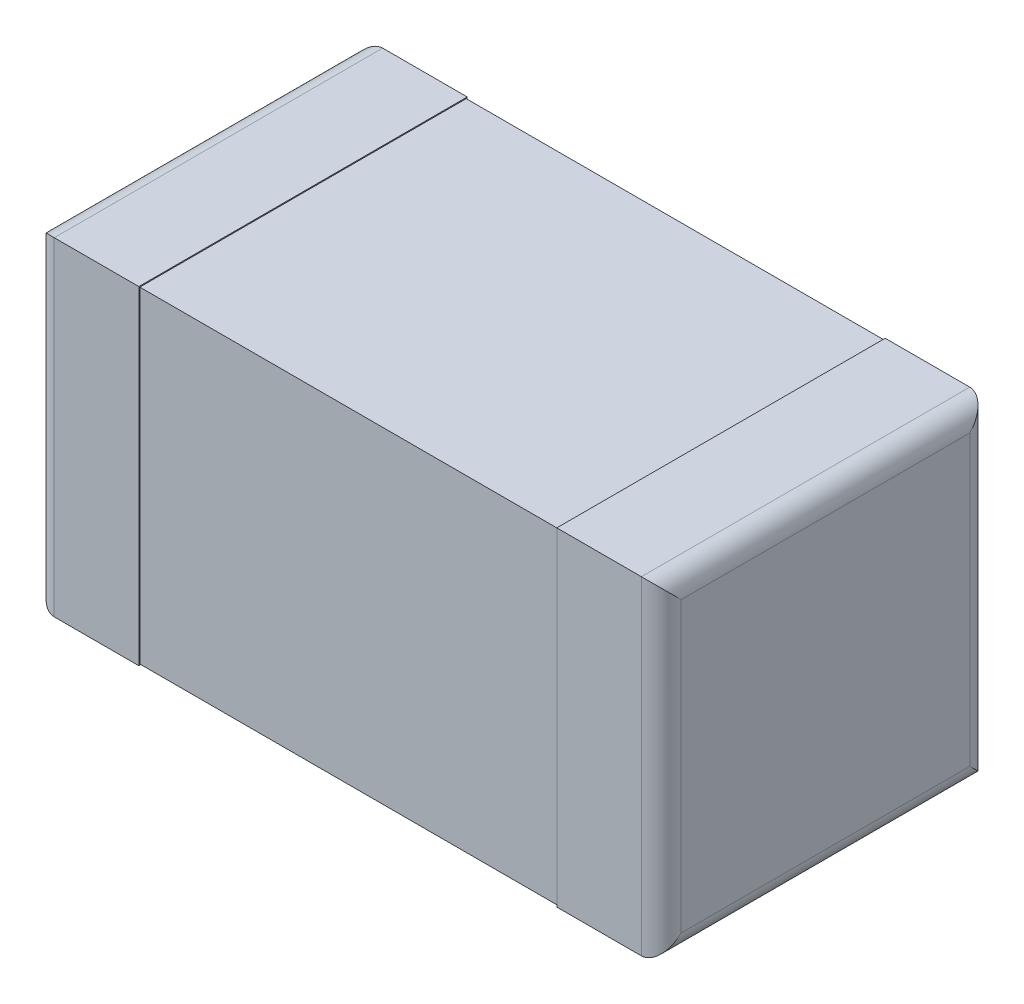
ISO-10303-21;
HEADER;
FILE_DESCRIPTION(('STEP AP214'),'2;1');
FILE_NAME('part.step','',(''),(''),'','','');
FILE_SCHEMA(('AUTOMOTIVE_DESIGN { 1 0 10303 214 1 1 1 1 }'));
ENDSEC;
DATA;
#1=APPLICATION_CONTEXT('core data for automotive mechanical design processes');
#2=APPLICATION_PROTOCOL_DEFINITION('international standard','automotive_design',2000,#1);
#3=PRODUCT_CONTEXT('',#1,'mechanical');
#4=PRODUCT('Part','Part','',(#3));
#5=PRODUCT_RELATED_PRODUCT_CATEGORY('part','',(#4));
#6=PRODUCT_DEFINITION_FORMATION('','',#4);
#7=PRODUCT_DEFINITION_CONTEXT('part definition',#1,'design');
#8=PRODUCT_DEFINITION('design','',#6,#7);
#9=PRODUCT_DEFINITION_SHAPE('','',#8);
#10=(LENGTH_UNIT() NAMED_UNIT(*) SI_UNIT(.MILLI.,.METRE.));
#11=(NAMED_UNIT(*) PLANE_ANGLE_UNIT() SI_UNIT($,.RADIAN.));
#12=(NAMED_UNIT(*) SI_UNIT($,.STERADIAN.) SOLID_ANGLE_UNIT());
#13=UNCERTAINTY_MEASURE_WITH_UNIT(LENGTH_MEASURE(1.E-05),#10,'distance_accuracy_value','');
#14=(GEOMETRIC_REPRESENTATION_CONTEXT(3) GLOBAL_UNCERTAINTY_ASSIGNED_CONTEXT((#13)) GLOBAL_UNIT_ASSIGNED_CONTEXT((#10,
#11,#12)) REPRESENTATION_CONTEXT('',''));
#15=CARTESIAN_POINT('',(0.,0.,0.));
#16=DIRECTION('',(0.,0.,1.));
#17=DIRECTION('',(1.,0.,0.));
#18=AXIS2_PLACEMENT_3D('',#15,#16,#17);
#19=CARTESIAN_POINT('',(0.,0.8382,0.8382));
#20=DIRECTION('',(1.,0.,0.));
#21=DIRECTION('',(0.,1.,0.));
#22=AXIS2_PLACEMENT_3D('',#19,#20,#21);
#23=PLANE('',#22);
#24=DIRECTION('',(0.,0.,-1.));
#25=VECTOR('',#24,1.);
#26=CARTESIAN_POINT('',(0.,0.0508,0.8382));
#27=LINE('',#26,#25);
#28=CARTESIAN_POINT('',(0.,0.0508,0.7874));
#29=VERTEX_POINT('',#28);
#30=CARTESIAN_POINT('',(0.,0.0508,0.0508));
#31=VERTEX_POINT('',#30);
#32=EDGE_CURVE('E195',#29,#31,#27,.T.);
#33=ORIENTED_EDGE('',*,*,#32,.F.);
#34=DIRECTION('',(0.,1.,0.));
#35=VECTOR('',#34,1.);
#36=CARTESIAN_POINT('',(0.,0.,0.7874));
#37=LINE('',#36,#35);
#38=CARTESIAN_POINT('',(0.,0.7874,0.7874));
#39=VERTEX_POINT('',#38);
#40=EDGE_CURVE('E154',#39,#29,#37,.F.);
#41=ORIENTED_EDGE('',*,*,#40,.F.);
#42=DIRECTION('',(0.,0.,-1.));
#43=VECTOR('',#42,1.);
#44=CARTESIAN_POINT('',(0.,0.7874,0.8382));
#45=LINE('',#44,#43);
#46=CARTESIAN_POINT('',(0.,0.7874,0.0508));
#47=VERTEX_POINT('',#46);
#48=EDGE_CURVE('E151',#47,#39,#45,.F.);
#49=ORIENTED_EDGE('',*,*,#48,.F.);
#50=DIRECTION('',(0.,-1.,0.));
#51=VECTOR('',#50,1.);
#52=CARTESIAN_POINT('',(0.,0.8382,0.0508));
#53=LINE('',#52,#51);
#54=EDGE_CURVE('E193',#31,#47,#53,.F.);
#55=ORIENTED_EDGE('',*,*,#54,.F.);
#56=EDGE_LOOP('',(#33,#41,#49,#55));
#57=FACE_BOUND('',#56,.T.);
#58=ADVANCED_FACE('F17',(#57),#23,.F.);
#59=CARTESIAN_POINT('',(1.6002,0.,0.8382));
#60=DIRECTION('',(-1.,0.,0.));
#61=DIRECTION('',(0.,0.,1.));
#62=AXIS2_PLACEMENT_3D('',#59,#60,#61);
#63=PLANE('',#62);
#64=DIRECTION('',(0.,0.,-1.));
#65=VECTOR('',#64,1.);
#66=CARTESIAN_POINT('',(1.6002,0.7874,0.8382));
#67=LINE('',#66,#65);
#68=CARTESIAN_POINT('',(1.6002,0.7874,0.7874));
#69=VERTEX_POINT('',#68);
#70=CARTESIAN_POINT('',(1.6002,0.7874,0.0508));
#71=VERTEX_POINT('',#70);
#72=EDGE_CURVE('E181',#69,#71,#67,.T.);
#73=ORIENTED_EDGE('',*,*,#72,.F.);
#74=DIRECTION('',(0.,-1.,0.));
#75=VECTOR('',#74,1.);
#76=CARTESIAN_POINT('',(1.6002,0.,0.7874));
#77=LINE('',#76,#75);
#78=CARTESIAN_POINT('',(1.6002,0.0508,0.7874));
#79=VERTEX_POINT('',#78);
#80=EDGE_CURVE('E185',#79,#69,#77,.F.);
#81=ORIENTED_EDGE('',*,*,#80,.F.);
#82=DIRECTION('',(0.,0.,-1.));
#83=VECTOR('',#82,1.);
#84=CARTESIAN_POINT('',(1.6002,0.0508,0.8382));
#85=LINE('',#84,#83);
#86=CARTESIAN_POINT('',(1.6002,0.0508,0.0508));
#87=VERTEX_POINT('',#86);
#88=EDGE_CURVE('E189',#87,#79,#85,.F.);
#89=ORIENTED_EDGE('',*,*,#88,.F.);
#90=DIRECTION('',(0.,1.,0.));
#91=VECTOR('',#90,1.);
#92=CARTESIAN_POINT('',(1.6002,0.,0.0508));
#93=LINE('',#92,#91);
#94=EDGE_CURVE('E138',#71,#87,#93,.F.);
#95=ORIENTED_EDGE('',*,*,#94,.F.);
#96=EDGE_LOOP('',(#73,#81,#89,#95));
#97=FACE_BOUND('',#96,.T.);
#98=ADVANCED_FACE('F382',(#97),#63,.F.);
#99=CARTESIAN_POINT('',(0.0508,0.7874,0.8382));
#100=DIRECTION('',(0.,0.,-1.));
#101=DIRECTION('',(-1.,0.,0.));
#102=AXIS2_PLACEMENT_3D('',#99,#100,#101);
#103=CYLINDRICAL_SURFACE('',#102,0.0508);
#104=CARTESIAN_POINT('',(0.0508,0.7874,0.7874));
#105=DIRECTION('',(0.,0.707106781186547,-0.707106781186547));
#106=DIRECTION('',(0.,0.707106781186547,0.707106781186547));
#107=AXIS2_PLACEMENT_3D('',#104,#105,#106);
#108=ELLIPSE('',#107,0.0718420489685532,0.0508);
#109=CARTESIAN_POINT('',(0.0508,0.8382,0.8382));
#110=VERTEX_POINT('',#109);
#111=EDGE_CURVE('E20',#110,#39,#108,.F.);
#112=ORIENTED_EDGE('',*,*,#111,.F.);
#113=DIRECTION('',(0.,0.,1.));
#114=VECTOR('',#113,1.);
#115=CARTESIAN_POINT('',(0.0507999999999999,0.8382,0.8382));
#116=LINE('',#115,#114);
#117=CARTESIAN_POINT('',(0.0508,0.8382,0.));
#118=VERTEX_POINT('',#117);
#119=EDGE_CURVE('E127',#110,#118,#116,.F.);
#120=ORIENTED_EDGE('',*,*,#119,.T.);
#121=CARTESIAN_POINT('',(0.0508,0.7874,0.0508));
#122=DIRECTION('',(0.,-0.707106781186547,-0.707106781186547));
#123=DIRECTION('',(0.,-0.707106781186547,0.707106781186547));
#124=AXIS2_PLACEMENT_3D('',#121,#122,#123);
#125=ELLIPSE('',#124,0.0718420489685532,0.0508);
#126=EDGE_CURVE('E194',#47,#118,#125,.T.);
#127=ORIENTED_EDGE('',*,*,#126,.F.);
#128=ORIENTED_EDGE('',*,*,#48,.T.);
#129=EDGE_LOOP('',(#112,#120,#127,#128));
#130=FACE_BOUND('',#129,.T.);
#131=ADVANCED_FACE('F150',(#130),#103,.T.);
#132=CARTESIAN_POINT('',(0.0508,0.,0.7874));
#133=DIRECTION('',(0.,1.,0.));
#134=DIRECTION('',(-1.,0.,0.));
#135=AXIS2_PLACEMENT_3D('',#132,#133,#134);
#136=CYLINDRICAL_SURFACE('',#135,0.0508);
#137=CARTESIAN_POINT('',(0.0508,0.0508,0.7874));
#138=DIRECTION('',(0.,-0.707106781186547,-0.707106781186547));
#139=DIRECTION('',(0.,0.707106781186547,-0.707106781186547));
#140=AXIS2_PLACEMENT_3D('',#137,#138,#139);
#141=ELLIPSE('',#140,0.0718420489685532,0.0508);
#142=CARTESIAN_POINT('',(0.0507999999999999,0.,0.8382));
#143=VERTEX_POINT('',#142);
#144=EDGE_CURVE('E157',#143,#29,#141,.T.);
#145=ORIENTED_EDGE('',*,*,#144,.F.);
#146=DIRECTION('',(0.,1.,0.));
#147=VECTOR('',#146,1.);
#148=CARTESIAN_POINT('',(0.0507999999999999,0.,0.8382));
#149=LINE('',#148,#147);
#150=EDGE_CURVE('E144',#110,#143,#149,.F.);
#151=ORIENTED_EDGE('',*,*,#150,.F.);
#152=ORIENTED_EDGE('',*,*,#111,.T.);
#153=ORIENTED_EDGE('',*,*,#40,.T.);
#154=EDGE_LOOP('',(#145,#151,#152,#153));
#155=FACE_BOUND('',#154,.T.);
#156=ADVANCED_FACE('F155',(#155),#136,.T.);
#157=CARTESIAN_POINT('',(0.0508,0.0508,0.8382));
#158=DIRECTION('',(0.,0.,-1.));
#159=DIRECTION('',(-1.,0.,0.));
#160=AXIS2_PLACEMENT_3D('',#157,#158,#159);
#161=CYLINDRICAL_SURFACE('',#160,0.0508);
#162=CARTESIAN_POINT('',(0.0508,0.0508,0.0508));
#163=DIRECTION('',(0.,-0.707106781186547,0.707106781186547));
#164=DIRECTION('',(0.,-0.707106781186547,-0.707106781186547));
#165=AXIS2_PLACEMENT_3D('',#162,#163,#164);
#166=ELLIPSE('',#165,0.0718420489685532,0.0508);
#167=CARTESIAN_POINT('',(0.0508,0.,0.));
#168=VERTEX_POINT('',#167);
#169=EDGE_CURVE('E190',#168,#31,#166,.F.);
#170=ORIENTED_EDGE('',*,*,#169,.F.);
#171=DIRECTION('',(0.,0.,1.));
#172=VECTOR('',#171,1.);
#173=CARTESIAN_POINT('',(0.0508,0.,0.8382));
#174=LINE('',#173,#172);
#175=EDGE_CURVE('E159',#168,#143,#174,.T.);
#176=ORIENTED_EDGE('',*,*,#175,.T.);
#177=ORIENTED_EDGE('',*,*,#144,.T.);
#178=ORIENTED_EDGE('',*,*,#32,.T.);
#179=EDGE_LOOP('',(#170,#176,#177,#178));
#180=FACE_BOUND('',#179,.T.);
#181=ADVANCED_FACE('F375',(#180),#161,.T.);
#182=CARTESIAN_POINT('',(0.0508,0.8382,0.0508));
#183=DIRECTION('',(0.,-1.,0.));
#184=DIRECTION('',(1.,0.,0.));
#185=AXIS2_PLACEMENT_3D('',#182,#183,#184);
#186=CYLINDRICAL_SURFACE('',#185,0.0508);
#187=ORIENTED_EDGE('',*,*,#169,.T.);
#188=ORIENTED_EDGE('',*,*,#54,.T.);
#189=ORIENTED_EDGE('',*,*,#126,.T.);
#190=DIRECTION('',(0.,1.,0.));
#191=VECTOR('',#190,1.);
#192=CARTESIAN_POINT('',(0.0507999999999999,0.,0.));
#193=LINE('',#192,#191);
#194=EDGE_CURVE('E214',#118,#168,#193,.F.);
#195=ORIENTED_EDGE('',*,*,#194,.T.);
#196=EDGE_LOOP('',(#187,#188,#189,#195));
#197=FACE_BOUND('',#196,.T.);
#198=ADVANCED_FACE('F371',(#197),#186,.T.);
#199=CARTESIAN_POINT('',(1.5494,0.0508,0.8382));
#200=DIRECTION('',(0.,0.,-1.));
#201=DIRECTION('',(-1.,0.,0.));
#202=AXIS2_PLACEMENT_3D('',#199,#200,#201);
#203=CYLINDRICAL_SURFACE('',#202,0.0508);
#204=CARTESIAN_POINT('',(1.5494,0.0508,0.7874));
#205=DIRECTION('',(0.,-0.707106781186547,-0.707106781186547));
#206=DIRECTION('',(0.,-0.707106781186547,0.707106781186547));
#207=AXIS2_PLACEMENT_3D('',#204,#205,#206);
#208=ELLIPSE('',#207,0.0718420489685532,0.0508);
#209=CARTESIAN_POINT('',(1.5494,0.,0.8382));
#210=VERTEX_POINT('',#209);
#211=EDGE_CURVE('E186',#210,#79,#208,.F.);
#212=ORIENTED_EDGE('',*,*,#211,.F.);
#213=DIRECTION('',(0.,0.,1.));
#214=VECTOR('',#213,1.);
#215=CARTESIAN_POINT('',(1.5494,0.,0.8382));
#216=LINE('',#215,#214);
#217=CARTESIAN_POINT('',(1.5494,0.,0.));
#218=VERTEX_POINT('',#217);
#219=EDGE_CURVE('E213',#210,#218,#216,.F.);
#220=ORIENTED_EDGE('',*,*,#219,.T.);
#221=CARTESIAN_POINT('',(1.5494,0.0508,0.0508));
#222=DIRECTION('',(0.,0.707106781186547,-0.707106781186547));
#223=DIRECTION('',(0.,0.707106781186547,0.707106781186547));
#224=AXIS2_PLACEMENT_3D('',#221,#222,#223);
#225=ELLIPSE('',#224,0.0718420489685532,0.0508);
#226=EDGE_CURVE('E179',#87,#218,#225,.T.);
#227=ORIENTED_EDGE('',*,*,#226,.F.);
#228=ORIENTED_EDGE('',*,*,#88,.T.);
#229=EDGE_LOOP('',(#212,#220,#227,#228));
#230=FACE_BOUND('',#229,.T.);
#231=ADVANCED_FACE('F367',(#230),#203,.T.);
#232=CARTESIAN_POINT('',(1.5494,0.,0.7874));
#233=DIRECTION('',(0.,-1.,0.));
#234=DIRECTION('',(0.,0.,-1.));
#235=AXIS2_PLACEMENT_3D('',#232,#233,#234);
#236=CYLINDRICAL_SURFACE('',#235,0.0508);
#237=CARTESIAN_POINT('',(1.5494,0.7874,0.7874));
#238=DIRECTION('',(0.,0.707106781186547,-0.707106781186547));
#239=DIRECTION('',(0.,-0.707106781186547,-0.707106781186547));
#240=AXIS2_PLACEMENT_3D('',#237,#238,#239);
#241=ELLIPSE('',#240,0.0718420489685532,0.0508);
#242=CARTESIAN_POINT('',(1.5494,0.8382,0.8382));
#243=VERTEX_POINT('',#242);
#244=EDGE_CURVE('E182',#243,#69,#241,.T.);
#245=ORIENTED_EDGE('',*,*,#244,.F.);
#246=DIRECTION('',(0.,1.,0.));
#247=VECTOR('',#246,1.);
#248=CARTESIAN_POINT('',(1.5494,0.,0.8382));
#249=LINE('',#248,#247);
#250=EDGE_CURVE('E234',#210,#243,#249,.T.);
#251=ORIENTED_EDGE('',*,*,#250,.F.);
#252=ORIENTED_EDGE('',*,*,#211,.T.);
#253=ORIENTED_EDGE('',*,*,#80,.T.);
#254=EDGE_LOOP('',(#245,#251,#252,#253));
#255=FACE_BOUND('',#254,.T.);
#256=ADVANCED_FACE('F363',(#255),#236,.T.);
#257=CARTESIAN_POINT('',(1.5494,0.7874,0.8382));
#258=DIRECTION('',(0.,0.,-1.));
#259=DIRECTION('',(-1.,0.,0.));
#260=AXIS2_PLACEMENT_3D('',#257,#258,#259);
#261=CYLINDRICAL_SURFACE('',#260,0.0508);
#262=CARTESIAN_POINT('',(1.5494,0.7874,0.0508));
#263=DIRECTION('',(0.,0.707106781186547,0.707106781186547));
#264=DIRECTION('',(0.,0.707106781186547,-0.707106781186547));
#265=AXIS2_PLACEMENT_3D('',#262,#263,#264);
#266=ELLIPSE('',#265,0.0718420489685532,0.0508);
#267=CARTESIAN_POINT('',(1.5494,0.8382,0.));
#268=VERTEX_POINT('',#267);
#269=EDGE_CURVE('E176',#268,#71,#266,.F.);
#270=ORIENTED_EDGE('',*,*,#269,.F.);
#271=DIRECTION('',(0.,0.,1.));
#272=VECTOR('',#271,1.);
#273=CARTESIAN_POINT('',(1.5494,0.8382,0.8382));
#274=LINE('',#273,#272);
#275=EDGE_CURVE('E237',#268,#243,#274,.T.);
#276=ORIENTED_EDGE('',*,*,#275,.T.);
#277=ORIENTED_EDGE('',*,*,#244,.T.);
#278=ORIENTED_EDGE('',*,*,#72,.T.);
#279=EDGE_LOOP('',(#270,#276,#277,#278));
#280=FACE_BOUND('',#279,.T.);
#281=ADVANCED_FACE('F359',(#280),#261,.T.);
#282=CARTESIAN_POINT('',(1.5494,0.,0.0508));
#283=DIRECTION('',(0.,1.,0.));
#284=DIRECTION('',(0.,0.,1.));
#285=AXIS2_PLACEMENT_3D('',#282,#283,#284);
#286=CYLINDRICAL_SURFACE('',#285,0.0508);
#287=ORIENTED_EDGE('',*,*,#269,.T.);
#288=ORIENTED_EDGE('',*,*,#94,.T.);
#289=ORIENTED_EDGE('',*,*,#226,.T.);
#290=DIRECTION('',(0.,1.,0.));
#291=VECTOR('',#290,1.);
#292=CARTESIAN_POINT('',(1.5494,0.,0.));
#293=LINE('',#292,#291);
#294=EDGE_CURVE('E261',#218,#268,#293,.T.);
#295=ORIENTED_EDGE('',*,*,#294,.T.);
#296=EDGE_LOOP('',(#287,#288,#289,#295));
#297=FACE_BOUND('',#296,.T.);
#298=ADVANCED_FACE('F356',(#297),#286,.T.);
#299=CARTESIAN_POINT('',(1.6002,0.8382,0.8382));
#300=DIRECTION('',(0.,-1.,0.));
#301=DIRECTION('',(1.,0.,0.));
#302=AXIS2_PLACEMENT_3D('',#299,#300,#301);
#303=PLANE('',#302);
#304=ORIENTED_EDGE('',*,*,#119,.F.);
#305=DIRECTION('',(1.,0.,0.));
#306=VECTOR('',#305,1.);
#307=CARTESIAN_POINT('',(0.,0.8382,0.8382));
#308=LINE('',#307,#306);
#309=CARTESIAN_POINT('',(0.2667,0.8382,0.8382));
#310=VERTEX_POINT('',#309);
#311=EDGE_CURVE('E131',#310,#110,#308,.F.);
#312=ORIENTED_EDGE('',*,*,#311,.F.);
#313=DIRECTION('',(0.,0.,1.));
#314=VECTOR('',#313,1.);
#315=CARTESIAN_POINT('',(0.2667,0.8382,0.83566));
#316=LINE('',#315,#314);
#317=CARTESIAN_POINT('',(0.2667,0.8382,0.));
#318=VERTEX_POINT('',#317);
#319=EDGE_CURVE('E172',#318,#310,#316,.T.);
#320=ORIENTED_EDGE('',*,*,#319,.F.);
#321=DIRECTION('',(1.,0.,0.));
#322=VECTOR('',#321,1.);
#323=CARTESIAN_POINT('',(0.,0.8382,0.));
#324=LINE('',#323,#322);
#325=EDGE_CURVE('E133',#318,#118,#324,.F.);
#326=ORIENTED_EDGE('',*,*,#325,.T.);
#327=EDGE_LOOP('',(#304,#312,#320,#326));
#328=FACE_BOUND('',#327,.T.);
#329=ADVANCED_FACE('F129',(#328),#303,.F.);
#330=CARTESIAN_POINT('',(0.,0.,0.8382));
#331=DIRECTION('',(0.,0.,1.));
#332=DIRECTION('',(1.,0.,0.));
#333=AXIS2_PLACEMENT_3D('',#330,#331,#332);
#334=PLANE('',#333);
#335=DIRECTION('',(1.,0.,0.));
#336=VECTOR('',#335,1.);
#337=CARTESIAN_POINT('',(0.,0.,0.8382));
#338=LINE('',#337,#336);
#339=CARTESIAN_POINT('',(0.2667,0.,0.8382));
#340=VERTEX_POINT('',#339);
#341=EDGE_CURVE('E162',#143,#340,#338,.T.);
#342=ORIENTED_EDGE('',*,*,#341,.T.);
#343=DIRECTION('',(0.,1.,0.));
#344=VECTOR('',#343,1.);
#345=CARTESIAN_POINT('',(0.2667,0.,0.8382));
#346=LINE('',#345,#344);
#347=EDGE_CURVE('E146',#310,#340,#346,.F.);
#348=ORIENTED_EDGE('',*,*,#347,.F.);
#349=ORIENTED_EDGE('',*,*,#311,.T.);
#350=ORIENTED_EDGE('',*,*,#150,.T.);
#351=EDGE_LOOP('',(#342,#348,#349,#350));
#352=FACE_BOUND('',#351,.T.);
#353=ADVANCED_FACE('F142',(#352),#334,.T.);
#354=CARTESIAN_POINT('',(0.,0.,0.8382));
#355=DIRECTION('',(0.,1.,0.));
#356=DIRECTION('',(0.,0.,1.));
#357=AXIS2_PLACEMENT_3D('',#354,#355,#356);
#358=PLANE('',#357);
#359=ORIENTED_EDGE('',*,*,#175,.F.);
#360=DIRECTION('',(1.,0.,0.));
#361=VECTOR('',#360,1.);
#362=CARTESIAN_POINT('',(0.,0.,0.));
#363=LINE('',#362,#361);
#364=CARTESIAN_POINT('',(0.2667,0.,0.));
#365=VERTEX_POINT('',#364);
#366=EDGE_CURVE('E210',#168,#365,#363,.T.);
#367=ORIENTED_EDGE('',*,*,#366,.T.);
#368=DIRECTION('',(0.,0.,1.));
#369=VECTOR('',#368,1.);
#370=CARTESIAN_POINT('',(0.2667,0.,0.83566));
#371=LINE('',#370,#369);
#372=EDGE_CURVE('E171',#340,#365,#371,.F.);
#373=ORIENTED_EDGE('',*,*,#372,.F.);
#374=ORIENTED_EDGE('',*,*,#341,.F.);
#375=EDGE_LOOP('',(#359,#367,#373,#374));
#376=FACE_BOUND('',#375,.T.);
#377=ADVANCED_FACE('F347',(#376),#358,.F.);
#378=CARTESIAN_POINT('',(0.,0.,0.));
#379=DIRECTION('',(0.,0.,1.));
#380=DIRECTION('',(1.,0.,0.));
#381=AXIS2_PLACEMENT_3D('',#378,#379,#380);
#382=PLANE('',#381);
#383=ORIENTED_EDGE('',*,*,#194,.F.);
#384=ORIENTED_EDGE('',*,*,#325,.F.);
#385=DIRECTION('',(0.,1.,0.));
#386=VECTOR('',#385,1.);
#387=CARTESIAN_POINT('',(0.2667,0.,0.));
#388=LINE('',#387,#386);
#389=EDGE_CURVE('E206',#365,#318,#388,.T.);
#390=ORIENTED_EDGE('',*,*,#389,.F.);
#391=ORIENTED_EDGE('',*,*,#366,.F.);
#392=EDGE_LOOP('',(#383,#384,#390,#391));
#393=FACE_BOUND('',#392,.T.);
#394=ADVANCED_FACE('F343',(#393),#382,.F.);
#395=CARTESIAN_POINT('',(0.2667,1.99143127423469,0.0025399999999999));
#396=DIRECTION('',(0.,0.,-1.));
#397=DIRECTION('',(-1.,0.,0.));
#398=AXIS2_PLACEMENT_3D('',#395,#396,#397);
#399=PLANE('',#398);
#400=DIRECTION('',(1.,0.,0.));
#401=VECTOR('',#400,1.);
#402=CARTESIAN_POINT('',(0.2667,0.83566,0.00253999999999988));
#403=LINE('',#402,#401);
#404=CARTESIAN_POINT('',(0.2667,0.83566,0.00253999999999988));
#405=VERTEX_POINT('',#404);
#406=CARTESIAN_POINT('',(1.3335,0.83566,0.00253999999999989));
#407=VERTEX_POINT('',#406);
#408=EDGE_CURVE('E278',#405,#407,#403,.T.);
#409=ORIENTED_EDGE('',*,*,#408,.T.);
#410=DIRECTION('',(0.,1.,0.));
#411=VECTOR('',#410,1.);
#412=CARTESIAN_POINT('',(1.3335,0.8382,0.00253999999999988));
#413=LINE('',#412,#411);
#414=CARTESIAN_POINT('',(1.3335,0.00254000000000005,0.00253999999999989));
#415=VERTEX_POINT('',#414);
#416=EDGE_CURVE('E281',#415,#407,#413,.T.);
#417=ORIENTED_EDGE('',*,*,#416,.F.);
#418=DIRECTION('',(-1.,0.,0.));
#419=VECTOR('',#418,1.);
#420=CARTESIAN_POINT('',(1.3335,0.00254000000000001,0.00253999999999988));
#421=LINE('',#420,#419);
#422=CARTESIAN_POINT('',(0.2667,0.00254000000000004,0.00253999999999989));
#423=VERTEX_POINT('',#422);
#424=EDGE_CURVE('E260',#415,#423,#421,.T.);
#425=ORIENTED_EDGE('',*,*,#424,.T.);
#426=DIRECTION('',(0.,1.,0.));
#427=VECTOR('',#426,1.);
#428=CARTESIAN_POINT('',(0.2667,0.,0.00253999999999988));
#429=LINE('',#428,#427);
#430=EDGE_CURVE('E272',#405,#423,#429,.F.);
#431=ORIENTED_EDGE('',*,*,#430,.F.);
#432=EDGE_LOOP('',(#409,#417,#425,#431));
#433=FACE_BOUND('',#432,.T.);
#434=ADVANCED_FACE('F339',(#433),#399,.T.);
#435=CARTESIAN_POINT('',(0.,0.,0.8382));
#436=DIRECTION('',(0.,1.,0.));
#437=DIRECTION('',(0.,0.,1.));
#438=AXIS2_PLACEMENT_3D('',#435,#436,#437);
#439=PLANE('',#438);
#440=ORIENTED_EDGE('',*,*,#219,.F.);
#441=DIRECTION('',(1.,0.,0.));
#442=VECTOR('',#441,1.);
#443=CARTESIAN_POINT('',(0.,0.,0.8382));
#444=LINE('',#443,#442);
#445=CARTESIAN_POINT('',(1.3335,0.,0.8382));
#446=VERTEX_POINT('',#445);
#447=EDGE_CURVE('E231',#446,#210,#444,.T.);
#448=ORIENTED_EDGE('',*,*,#447,.F.);
#449=DIRECTION('',(0.,0.,1.));
#450=VECTOR('',#449,1.);
#451=CARTESIAN_POINT('',(1.3335,0.,0.83566));
#452=LINE('',#451,#450);
#453=CARTESIAN_POINT('',(1.3335,0.,0.));
#454=VERTEX_POINT('',#453);
#455=EDGE_CURVE('E228',#454,#446,#452,.T.);
#456=ORIENTED_EDGE('',*,*,#455,.F.);
#457=DIRECTION('',(1.,0.,0.));
#458=VECTOR('',#457,1.);
#459=CARTESIAN_POINT('',(0.,0.,0.));
#460=LINE('',#459,#458);
#461=EDGE_CURVE('E241',#454,#218,#460,.T.);
#462=ORIENTED_EDGE('',*,*,#461,.T.);
#463=EDGE_LOOP('',(#440,#448,#456,#462));
#464=FACE_BOUND('',#463,.T.);
#465=ADVANCED_FACE('F335',(#464),#439,.F.);
#466=CARTESIAN_POINT('',(0.,0.,0.8382));
#467=DIRECTION('',(0.,0.,1.));
#468=DIRECTION('',(1.,0.,0.));
#469=AXIS2_PLACEMENT_3D('',#466,#467,#468);
#470=PLANE('',#469);
#471=DIRECTION('',(1.,0.,0.));
#472=VECTOR('',#471,1.);
#473=CARTESIAN_POINT('',(1.6002,0.8382,0.8382));
#474=LINE('',#473,#472);
#475=CARTESIAN_POINT('',(1.3335,0.8382,0.8382));
#476=VERTEX_POINT('',#475);
#477=EDGE_CURVE('E238',#243,#476,#474,.F.);
#478=ORIENTED_EDGE('',*,*,#477,.T.);
#479=DIRECTION('',(0.,1.,0.));
#480=VECTOR('',#479,1.);
#481=CARTESIAN_POINT('',(1.3335,0.8382,0.8382));
#482=LINE('',#481,#480);
#483=EDGE_CURVE('E225',#446,#476,#482,.T.);
#484=ORIENTED_EDGE('',*,*,#483,.F.);
#485=ORIENTED_EDGE('',*,*,#447,.T.);
#486=ORIENTED_EDGE('',*,*,#250,.T.);
#487=EDGE_LOOP('',(#478,#484,#485,#486));
#488=FACE_BOUND('',#487,.T.);
#489=ADVANCED_FACE('F331',(#488),#470,.T.);
#490=CARTESIAN_POINT('',(1.6002,0.8382,0.8382));
#491=DIRECTION('',(0.,-1.,0.));
#492=DIRECTION('',(1.,0.,0.));
#493=AXIS2_PLACEMENT_3D('',#490,#491,#492);
#494=PLANE('',#493);
#495=ORIENTED_EDGE('',*,*,#275,.F.);
#496=DIRECTION('',(1.,0.,0.));
#497=VECTOR('',#496,1.);
#498=CARTESIAN_POINT('',(0.,0.8382,0.));
#499=LINE('',#498,#497);
#500=CARTESIAN_POINT('',(1.3335,0.8382,0.));
#501=VERTEX_POINT('',#500);
#502=EDGE_CURVE('E257',#268,#501,#499,.F.);
#503=ORIENTED_EDGE('',*,*,#502,.T.);
#504=DIRECTION('',(0.,0.,1.));
#505=VECTOR('',#504,1.);
#506=CARTESIAN_POINT('',(1.3335,0.8382,0.83566));
#507=LINE('',#506,#505);
#508=EDGE_CURVE('E227',#476,#501,#507,.F.);
#509=ORIENTED_EDGE('',*,*,#508,.F.);
#510=ORIENTED_EDGE('',*,*,#477,.F.);
#511=EDGE_LOOP('',(#495,#503,#509,#510));
#512=FACE_BOUND('',#511,.T.);
#513=ADVANCED_FACE('F327',(#512),#494,.F.);
#514=CARTESIAN_POINT('',(0.,0.,0.));
#515=DIRECTION('',(0.,0.,1.));
#516=DIRECTION('',(1.,0.,0.));
#517=AXIS2_PLACEMENT_3D('',#514,#515,#516);
#518=PLANE('',#517);
#519=ORIENTED_EDGE('',*,*,#294,.F.);
#520=ORIENTED_EDGE('',*,*,#461,.F.);
#521=DIRECTION('',(0.,1.,0.));
#522=VECTOR('',#521,1.);
#523=CARTESIAN_POINT('',(1.3335,0.8382,0.));
#524=LINE('',#523,#522);
#525=EDGE_CURVE('E249',#501,#454,#524,.F.);
#526=ORIENTED_EDGE('',*,*,#525,.F.);
#527=ORIENTED_EDGE('',*,*,#502,.F.);
#528=EDGE_LOOP('',(#519,#520,#526,#527));
#529=FACE_BOUND('',#528,.T.);
#530=ADVANCED_FACE('F324',(#529),#518,.F.);
#531=CARTESIAN_POINT('',(1.3335,0.00254000000000001,-1.15577127423469));
#532=DIRECTION('',(0.,1.,0.));
#533=DIRECTION('',(-1.,0.,0.));
#534=AXIS2_PLACEMENT_3D('',#531,#532,#533);
#535=PLANE('',#534);
#536=DIRECTION('',(0.,0.,1.));
#537=VECTOR('',#536,1.);
#538=CARTESIAN_POINT('',(1.3335,0.00253999999999999,0.83566));
#539=LINE('',#538,#537);
#540=CARTESIAN_POINT('',(1.3335,0.00254,0.83566));
#541=VERTEX_POINT('',#540);
#542=EDGE_CURVE('E246',#541,#415,#539,.F.);
#543=ORIENTED_EDGE('',*,*,#542,.F.);
#544=DIRECTION('',(-1.,0.,0.));
#545=VECTOR('',#544,1.);
#546=CARTESIAN_POINT('',(0.,0.00254000000000001,0.83566));
#547=LINE('',#546,#545);
#548=CARTESIAN_POINT('',(0.2667,0.00253999999999996,0.83566));
#549=VERTEX_POINT('',#548);
#550=EDGE_CURVE('E252',#541,#549,#547,.T.);
#551=ORIENTED_EDGE('',*,*,#550,.T.);
#552=DIRECTION('',(0.,0.,1.));
#553=VECTOR('',#552,1.);
#554=CARTESIAN_POINT('',(0.2667,0.00254000000000009,0.83566));
#555=LINE('',#554,#553);
#556=EDGE_CURVE('E203',#423,#549,#555,.T.);
#557=ORIENTED_EDGE('',*,*,#556,.F.);
#558=ORIENTED_EDGE('',*,*,#424,.F.);
#559=EDGE_LOOP('',(#543,#551,#557,#558));
#560=FACE_BOUND('',#559,.T.);
#561=ADVANCED_FACE('F305',(#560),#535,.F.);
#562=CARTESIAN_POINT('',(0.2667,0.,0.83566));
#563=DIRECTION('',(1.,0.,0.));
#564=DIRECTION('',(0.,1.,0.));
#565=AXIS2_PLACEMENT_3D('',#562,#563,#564);
#566=PLANE('',#565);
#567=ORIENTED_EDGE('',*,*,#372,.T.);
#568=ORIENTED_EDGE('',*,*,#389,.T.);
#569=ORIENTED_EDGE('',*,*,#319,.T.);
#570=ORIENTED_EDGE('',*,*,#347,.T.);
#571=EDGE_LOOP('',(#567,#568,#569,#570));
#572=FACE_BOUND('',#571,.T.);
#573=ORIENTED_EDGE('',*,*,#556,.T.);
#574=DIRECTION('',(0.,1.,0.));
#575=VECTOR('',#574,1.);
#576=CARTESIAN_POINT('',(0.2667,0.,0.83566));
#577=LINE('',#576,#575);
#578=CARTESIAN_POINT('',(0.2667,0.83566,0.83566));
#579=VERTEX_POINT('',#578);
#580=EDGE_CURVE('E289',#549,#579,#577,.T.);
#581=ORIENTED_EDGE('',*,*,#580,.T.);
#582=DIRECTION('',(0.,0.,-1.));
#583=VECTOR('',#582,1.);
#584=CARTESIAN_POINT('',(0.2667,0.83566,-1.15577127423469));
#585=LINE('',#584,#583);
#586=EDGE_CURVE('E208',#579,#405,#585,.T.);
#587=ORIENTED_EDGE('',*,*,#586,.T.);
#588=ORIENTED_EDGE('',*,*,#430,.T.);
#589=EDGE_LOOP('',(#573,#581,#587,#588));
#590=FACE_BOUND('',#589,.T.);
#591=ADVANCED_FACE('F301',(#572,#590),#566,.T.);
#592=CARTESIAN_POINT('',(0.2667,0.83566,-1.15577127423469));
#593=DIRECTION('',(0.,-1.,0.));
#594=DIRECTION('',(0.,0.,-1.));
#595=AXIS2_PLACEMENT_3D('',#592,#593,#594);
#596=PLANE('',#595);
#597=ORIENTED_EDGE('',*,*,#586,.F.);
#598=DIRECTION('',(-1.,0.,0.));
#599=VECTOR('',#598,1.);
#600=CARTESIAN_POINT('',(0.,0.83566,0.83566));
#601=LINE('',#600,#599);
#602=CARTESIAN_POINT('',(1.3335,0.83566,0.83566));
#603=VERTEX_POINT('',#602);
#604=EDGE_CURVE('E26',#579,#603,#601,.F.);
#605=ORIENTED_EDGE('',*,*,#604,.T.);
#606=DIRECTION('',(0.,0.,1.));
#607=VECTOR('',#606,1.);
#608=CARTESIAN_POINT('',(1.3335,0.83566,0.83566));
#609=LINE('',#608,#607);
#610=EDGE_CURVE('E34',#407,#603,#609,.T.);
#611=ORIENTED_EDGE('',*,*,#610,.F.);
#612=ORIENTED_EDGE('',*,*,#408,.F.);
#613=EDGE_LOOP('',(#597,#605,#611,#612));
#614=FACE_BOUND('',#613,.T.);
#615=ADVANCED_FACE('F295',(#614),#596,.F.);
#616=CARTESIAN_POINT('',(1.3335,0.8382,0.83566));
#617=DIRECTION('',(-1.,0.,0.));
#618=DIRECTION('',(0.,0.,1.));
#619=AXIS2_PLACEMENT_3D('',#616,#617,#618);
#620=PLANE('',#619);
#621=ORIENTED_EDGE('',*,*,#508,.T.);
#622=ORIENTED_EDGE('',*,*,#525,.T.);
#623=ORIENTED_EDGE('',*,*,#455,.T.);
#624=ORIENTED_EDGE('',*,*,#483,.T.);
#625=EDGE_LOOP('',(#621,#622,#623,#624));
#626=FACE_BOUND('',#625,.T.);
#627=DIRECTION('',(0.,1.,0.));
#628=VECTOR('',#627,1.);
#629=CARTESIAN_POINT('',(1.3335,0.,0.83566));
#630=LINE('',#629,#628);
#631=EDGE_CURVE('E11',#603,#541,#630,.F.);
#632=ORIENTED_EDGE('',*,*,#631,.T.);
#633=ORIENTED_EDGE('',*,*,#542,.T.);
#634=ORIENTED_EDGE('',*,*,#416,.T.);
#635=ORIENTED_EDGE('',*,*,#610,.T.);
#636=EDGE_LOOP('',(#632,#633,#634,#635));
#637=FACE_BOUND('',#636,.T.);
#638=ADVANCED_FACE('F307',(#626,#637),#620,.T.);
#639=CARTESIAN_POINT('',(0.,0.,0.83566));
#640=DIRECTION('',(0.,0.,-1.));
#641=DIRECTION('',(-1.,0.,0.));
#642=AXIS2_PLACEMENT_3D('',#639,#640,#641);
#643=PLANE('',#642);
#644=ORIENTED_EDGE('',*,*,#604,.F.);
#645=ORIENTED_EDGE('',*,*,#580,.F.);
#646=ORIENTED_EDGE('',*,*,#550,.F.);
#647=ORIENTED_EDGE('',*,*,#631,.F.);
#648=EDGE_LOOP('',(#644,#645,#646,#647));
#649=FACE_BOUND('',#648,.T.);
#650=ADVANCED_FACE('F299',(#649),#643,.F.);
#651=CLOSED_SHELL('',(#58,#98,#131,#156,#181,#198,#231,#256,#281,#298,#329,#353,#377,#394,#434,
#465,#489,#513,#530,#561,#591,#615,#638,#650));
#652=MANIFOLD_SOLID_BREP('B1',#651);
#653=ADVANCED_BREP_SHAPE_REPRESENTATION('',(#18,#652),#14);
#654=SHAPE_DEFINITION_REPRESENTATION(#9,#653);
ENDSEC;
END-ISO-10303-21;
